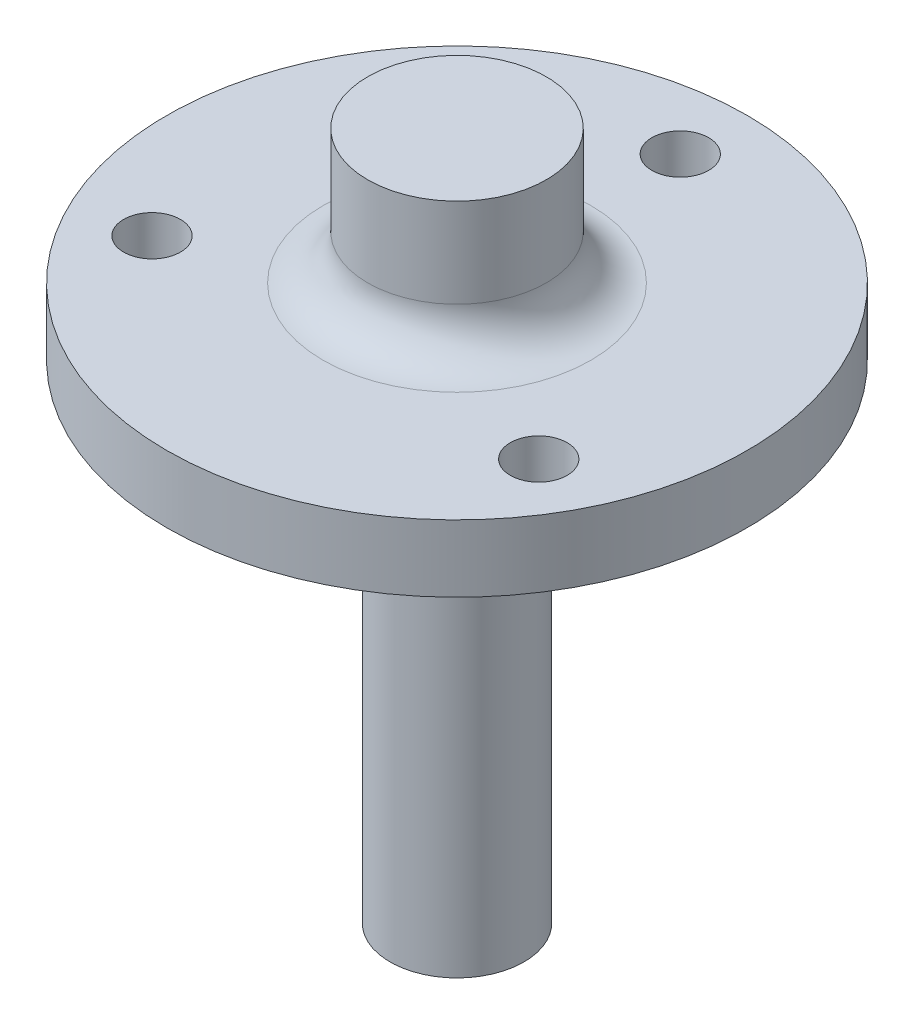
ISO-10303-21;
HEADER;
FILE_DESCRIPTION(('STEP AP214'),'2;1');
FILE_NAME('part.step','',(''),(''),'','','');
FILE_SCHEMA(('AUTOMOTIVE_DESIGN { 1 0 10303 214 1 1 1 1 }'));
ENDSEC;
DATA;
#1=APPLICATION_CONTEXT('core data for automotive mechanical design processes');
#2=APPLICATION_PROTOCOL_DEFINITION('international standard','automotive_design',2000,#1);
#3=PRODUCT_CONTEXT('',#1,'mechanical');
#4=PRODUCT('Part','Part','',(#3));
#5=PRODUCT_RELATED_PRODUCT_CATEGORY('part','',(#4));
#6=PRODUCT_DEFINITION_FORMATION('','',#4);
#7=PRODUCT_DEFINITION_CONTEXT('part definition',#1,'design');
#8=PRODUCT_DEFINITION('design','',#6,#7);
#9=PRODUCT_DEFINITION_SHAPE('','',#8);
#10=(LENGTH_UNIT() NAMED_UNIT(*) SI_UNIT(.MILLI.,.METRE.));
#11=(NAMED_UNIT(*) PLANE_ANGLE_UNIT() SI_UNIT($,.RADIAN.));
#12=(NAMED_UNIT(*) SI_UNIT($,.STERADIAN.) SOLID_ANGLE_UNIT());
#13=UNCERTAINTY_MEASURE_WITH_UNIT(LENGTH_MEASURE(1.E-05),#10,'distance_accuracy_value','');
#14=(GEOMETRIC_REPRESENTATION_CONTEXT(3) GLOBAL_UNCERTAINTY_ASSIGNED_CONTEXT((#13)) GLOBAL_UNIT_ASSIGNED_CONTEXT((#10,
#11,#12)) REPRESENTATION_CONTEXT('',''));
#15=CARTESIAN_POINT('',(0.,0.,0.));
#16=DIRECTION('',(0.,0.,1.));
#17=DIRECTION('',(1.,0.,0.));
#18=AXIS2_PLACEMENT_3D('',#15,#16,#17);
#19=CARTESIAN_POINT('',(0.,4.7625,0.));
#20=DIRECTION('',(0.,-1.,0.));
#21=DIRECTION('',(0.,0.,-1.));
#22=AXIS2_PLACEMENT_3D('',#19,#20,#21);
#23=CYLINDRICAL_SURFACE('',#22,20.6375);
#24=CARTESIAN_POINT('',(0.,4.7625,0.));
#25=DIRECTION('',(0.,1.,0.));
#26=DIRECTION('',(0.,0.,1.));
#27=AXIS2_PLACEMENT_3D('',#24,#25,#26);
#28=CIRCLE('',#27,20.6375);
#29=CARTESIAN_POINT('',(0.,4.7625,20.6375));
#30=VERTEX_POINT('',#29);
#31=EDGE_CURVE('E75',#30,#30,#28,.T.);
#32=ORIENTED_EDGE('',*,*,#31,.F.);
#33=EDGE_LOOP('',(#32));
#34=FACE_BOUND('',#33,.T.);
#35=CARTESIAN_POINT('',(0.,0.,0.));
#36=DIRECTION('',(0.,1.,0.));
#37=DIRECTION('',(0.,0.,1.));
#38=AXIS2_PLACEMENT_3D('',#35,#36,#37);
#39=CIRCLE('',#38,20.6375);
#40=CARTESIAN_POINT('',(0.,0.,20.6375));
#41=VERTEX_POINT('',#40);
#42=EDGE_CURVE('E72',#41,#41,#39,.T.);
#43=ORIENTED_EDGE('',*,*,#42,.T.);
#44=EDGE_LOOP('',(#43));
#45=FACE_BOUND('',#44,.T.);
#46=ADVANCED_FACE('F35',(#34,#45),#23,.T.);
#47=CARTESIAN_POINT('',(0.,4.7625,0.));
#48=DIRECTION('',(0.,1.,0.));
#49=DIRECTION('',(0.,0.,1.));
#50=AXIS2_PLACEMENT_3D('',#47,#48,#49);
#51=PLANE('',#50);
#52=CARTESIAN_POINT('',(0.,4.7625,0.));
#53=DIRECTION('',(0.,1.,0.));
#54=DIRECTION('',(0.,0.,1.));
#55=AXIS2_PLACEMENT_3D('',#52,#53,#54);
#56=CIRCLE('',#55,9.525);
#57=CARTESIAN_POINT('',(0.,4.7625,9.525));
#58=VERTEX_POINT('',#57);
#59=EDGE_CURVE('E11',#58,#58,#56,.F.);
#60=ORIENTED_EDGE('',*,*,#59,.T.);
#61=EDGE_LOOP('',(#60));
#62=FACE_BOUND('',#61,.T.);
#63=CARTESIAN_POINT('',(13.748153285078,4.7625,7.9375));
#64=DIRECTION('',(0.,-1.,0.));
#65=DIRECTION('',(0.,0.,-1.));
#66=AXIS2_PLACEMENT_3D('',#63,#64,#65);
#67=CIRCLE('',#66,2.0193);
#68=CARTESIAN_POINT('',(13.748153285078,4.7625,5.9182));
#69=VERTEX_POINT('',#68);
#70=EDGE_CURVE('E266',#69,#69,#67,.T.);
#71=ORIENTED_EDGE('',*,*,#70,.T.);
#72=EDGE_LOOP('',(#71));
#73=FACE_BOUND('',#72,.T.);
#74=CARTESIAN_POINT('',(0.,4.7625,-15.875));
#75=DIRECTION('',(0.,-1.,0.));
#76=DIRECTION('',(0.,0.,-1.));
#77=AXIS2_PLACEMENT_3D('',#74,#75,#76);
#78=CIRCLE('',#77,2.0193);
#79=CARTESIAN_POINT('',(0.,4.7625,-17.8943));
#80=VERTEX_POINT('',#79);
#81=EDGE_CURVE('E279',#80,#80,#78,.T.);
#82=ORIENTED_EDGE('',*,*,#81,.T.);
#83=EDGE_LOOP('',(#82));
#84=FACE_BOUND('',#83,.T.);
#85=CARTESIAN_POINT('',(-13.748153285078,4.7625,7.9375));
#86=DIRECTION('',(0.,-1.,0.));
#87=DIRECTION('',(0.,0.,-1.));
#88=AXIS2_PLACEMENT_3D('',#85,#86,#87);
#89=CIRCLE('',#88,2.0193);
#90=CARTESIAN_POINT('',(-13.748153285078,4.7625,5.9182));
#91=VERTEX_POINT('',#90);
#92=EDGE_CURVE('E285',#91,#91,#89,.T.);
#93=ORIENTED_EDGE('',*,*,#92,.T.);
#94=EDGE_LOOP('',(#93));
#95=FACE_BOUND('',#94,.T.);
#96=ORIENTED_EDGE('',*,*,#31,.T.);
#97=EDGE_LOOP('',(#96));
#98=FACE_BOUND('',#97,.T.);
#99=ADVANCED_FACE('F95',(#62,#73,#84,#95,#98),#51,.T.);
#100=CARTESIAN_POINT('',(0.,0.,0.));
#101=DIRECTION('',(0.,1.,0.));
#102=DIRECTION('',(0.,0.,1.));
#103=AXIS2_PLACEMENT_3D('',#100,#101,#102);
#104=PLANE('',#103);
#105=CARTESIAN_POINT('',(13.748153285078,0.,7.9375));
#106=DIRECTION('',(0.,-1.,0.));
#107=DIRECTION('',(0.,0.,-1.));
#108=AXIS2_PLACEMENT_3D('',#105,#106,#107);
#109=CIRCLE('',#108,2.01929999999999);
#110=CARTESIAN_POINT('',(13.748153285078,0.,5.91820000000001));
#111=VERTEX_POINT('',#110);
#112=EDGE_CURVE('E269',#111,#111,#109,.T.);
#113=ORIENTED_EDGE('',*,*,#112,.F.);
#114=EDGE_LOOP('',(#113));
#115=FACE_BOUND('',#114,.T.);
#116=CARTESIAN_POINT('',(0.,0.,-15.875));
#117=DIRECTION('',(0.,-1.,0.));
#118=DIRECTION('',(0.,0.,-1.));
#119=AXIS2_PLACEMENT_3D('',#116,#117,#118);
#120=CIRCLE('',#119,2.01929999999999);
#121=CARTESIAN_POINT('',(0.,0.,-17.8943));
#122=VERTEX_POINT('',#121);
#123=EDGE_CURVE('E272',#122,#122,#120,.T.);
#124=ORIENTED_EDGE('',*,*,#123,.F.);
#125=EDGE_LOOP('',(#124));
#126=FACE_BOUND('',#125,.T.);
#127=CARTESIAN_POINT('',(-13.748153285078,0.,7.9375));
#128=DIRECTION('',(0.,-1.,0.));
#129=DIRECTION('',(0.,0.,-1.));
#130=AXIS2_PLACEMENT_3D('',#127,#128,#129);
#131=CIRCLE('',#130,2.01929999999999);
#132=CARTESIAN_POINT('',(-13.748153285078,0.,5.91820000000001));
#133=VERTEX_POINT('',#132);
#134=EDGE_CURVE('E282',#133,#133,#131,.T.);
#135=ORIENTED_EDGE('',*,*,#134,.F.);
#136=EDGE_LOOP('',(#135));
#137=FACE_BOUND('',#136,.T.);
#138=CARTESIAN_POINT('',(0.,0.,0.));
#139=DIRECTION('',(0.,-1.,0.));
#140=DIRECTION('',(0.,0.,-1.));
#141=AXIS2_PLACEMENT_3D('',#138,#139,#140);
#142=CIRCLE('',#141,8.73125);
#143=CARTESIAN_POINT('',(0.,0.,-8.73125));
#144=VERTEX_POINT('',#143);
#145=EDGE_CURVE('E69',#144,#144,#142,.T.);
#146=ORIENTED_EDGE('',*,*,#145,.F.);
#147=EDGE_LOOP('',(#146));
#148=FACE_BOUND('',#147,.T.);
#149=ORIENTED_EDGE('',*,*,#42,.F.);
#150=EDGE_LOOP('',(#149));
#151=FACE_BOUND('',#150,.T.);
#152=ADVANCED_FACE('F101',(#115,#126,#137,#148,#151),#104,.F.);
#153=CARTESIAN_POINT('',(0.,-6.096,0.));
#154=DIRECTION('',(0.,1.,0.));
#155=DIRECTION('',(0.,0.,1.));
#156=AXIS2_PLACEMENT_3D('',#153,#154,#155);
#157=CYLINDRICAL_SURFACE('',#156,8.73125);
#158=CARTESIAN_POINT('',(0.,-6.096,0.));
#159=DIRECTION('',(0.,-1.,0.));
#160=DIRECTION('',(0.,0.,-1.));
#161=AXIS2_PLACEMENT_3D('',#158,#159,#160);
#162=CIRCLE('',#161,8.73125);
#163=CARTESIAN_POINT('',(0.,-6.096,-8.73125));
#164=VERTEX_POINT('',#163);
#165=EDGE_CURVE('E59',#164,#164,#162,.T.);
#166=ORIENTED_EDGE('',*,*,#165,.F.);
#167=EDGE_LOOP('',(#166));
#168=FACE_BOUND('',#167,.T.);
#169=ORIENTED_EDGE('',*,*,#145,.T.);
#170=EDGE_LOOP('',(#169));
#171=FACE_BOUND('',#170,.T.);
#172=ADVANCED_FACE('F108',(#168,#171),#157,.T.);
#173=CARTESIAN_POINT('',(0.,-6.096,0.));
#174=DIRECTION('',(0.,-1.,0.));
#175=DIRECTION('',(0.,0.,-1.));
#176=AXIS2_PLACEMENT_3D('',#173,#174,#175);
#177=PLANE('',#176);
#178=CARTESIAN_POINT('',(0.,-6.096,0.));
#179=DIRECTION('',(0.,-1.,0.));
#180=DIRECTION('',(0.,0.,-1.));
#181=AXIS2_PLACEMENT_3D('',#178,#179,#180);
#182=CIRCLE('',#181,4.7625);
#183=CARTESIAN_POINT('',(0.,-6.096,-4.7625));
#184=VERTEX_POINT('',#183);
#185=EDGE_CURVE('E66',#184,#184,#182,.T.);
#186=ORIENTED_EDGE('',*,*,#185,.F.);
#187=EDGE_LOOP('',(#186));
#188=FACE_BOUND('',#187,.T.);
#189=ORIENTED_EDGE('',*,*,#165,.T.);
#190=EDGE_LOOP('',(#189));
#191=FACE_BOUND('',#190,.T.);
#192=ADVANCED_FACE('F113',(#188,#191),#177,.T.);
#193=CARTESIAN_POINT('',(0.,-34.671,0.));
#194=DIRECTION('',(0.,1.,0.));
#195=DIRECTION('',(0.,0.,1.));
#196=AXIS2_PLACEMENT_3D('',#193,#194,#195);
#197=CYLINDRICAL_SURFACE('',#196,4.7625);
#198=CARTESIAN_POINT('',(0.,-34.671,0.));
#199=DIRECTION('',(0.,-1.,0.));
#200=DIRECTION('',(0.,0.,-1.));
#201=AXIS2_PLACEMENT_3D('',#198,#199,#200);
#202=CIRCLE('',#201,4.7625);
#203=CARTESIAN_POINT('',(0.,-34.671,-4.7625));
#204=VERTEX_POINT('',#203);
#205=EDGE_CURVE('E55',#204,#204,#202,.T.);
#206=ORIENTED_EDGE('',*,*,#205,.F.);
#207=EDGE_LOOP('',(#206));
#208=FACE_BOUND('',#207,.T.);
#209=ORIENTED_EDGE('',*,*,#185,.T.);
#210=EDGE_LOOP('',(#209));
#211=FACE_BOUND('',#210,.T.);
#212=ADVANCED_FACE('F117',(#208,#211),#197,.T.);
#213=CARTESIAN_POINT('',(0.,-34.671,0.));
#214=DIRECTION('',(0.,-1.,0.));
#215=DIRECTION('',(0.,0.,-1.));
#216=AXIS2_PLACEMENT_3D('',#213,#214,#215);
#217=PLANE('',#216);
#218=CARTESIAN_POINT('',(0.,-34.671,0.));
#219=DIRECTION('',(0.,-1.,0.));
#220=DIRECTION('',(0.,0.,-1.));
#221=AXIS2_PLACEMENT_3D('',#218,#219,#220);
#222=CIRCLE('',#221,3.17499999999999);
#223=CARTESIAN_POINT('',(0.,-34.671,-3.17499999999999));
#224=VERTEX_POINT('',#223);
#225=EDGE_CURVE('E288',#224,#224,#222,.T.);
#226=ORIENTED_EDGE('',*,*,#225,.F.);
#227=EDGE_LOOP('',(#226));
#228=FACE_BOUND('',#227,.T.);
#229=ORIENTED_EDGE('',*,*,#205,.T.);
#230=EDGE_LOOP('',(#229));
#231=FACE_BOUND('',#230,.T.);
#232=ADVANCED_FACE('F49',(#228,#231),#217,.T.);
#233=CARTESIAN_POINT('',(0.,-5.46100000000001,0.));
#234=DIRECTION('',(0.,-1.,0.));
#235=DIRECTION('',(0.,0.,-1.));
#236=AXIS2_PLACEMENT_3D('',#233,#234,#235);
#237=CONICAL_SURFACE('',#236,2.55269999999999,1.02974425867665);
#238=CARTESIAN_POINT('',(0.,-3.92718309780837,0.));
#239=VERTEX_POINT('',#238);
#240=VERTEX_LOOP('',#239);
#241=FACE_BOUND('',#240,.T.);
#242=CARTESIAN_POINT('',(0.,-5.46100000000001,0.));
#243=DIRECTION('',(0.,-1.,0.));
#244=DIRECTION('',(0.,0.,-1.));
#245=AXIS2_PLACEMENT_3D('',#242,#243,#244);
#246=CIRCLE('',#245,2.55269999999999);
#247=CARTESIAN_POINT('',(0.,-5.46100000000001,-2.55269999999999));
#248=VERTEX_POINT('',#247);
#249=EDGE_CURVE('E53',#248,#248,#246,.T.);
#250=ORIENTED_EDGE('',*,*,#249,.T.);
#251=EDGE_LOOP('',(#250));
#252=FACE_BOUND('',#251,.T.);
#253=ADVANCED_FACE('F45',(#241,#252),#237,.F.);
#254=CARTESIAN_POINT('',(0.,-34.671,0.));
#255=DIRECTION('',(0.,-1.,0.));
#256=DIRECTION('',(0.,0.,-1.));
#257=AXIS2_PLACEMENT_3D('',#254,#255,#256);
#258=CYLINDRICAL_SURFACE('',#257,2.55269999999999);
#259=ORIENTED_EDGE('',*,*,#249,.F.);
#260=EDGE_LOOP('',(#259));
#261=FACE_BOUND('',#260,.T.);
#262=CARTESIAN_POINT('',(0.,-9.271,0.));
#263=DIRECTION('',(0.,-1.,0.));
#264=DIRECTION('',(0.,0.,-1.));
#265=AXIS2_PLACEMENT_3D('',#262,#263,#264);
#266=CIRCLE('',#265,2.55269999999999);
#267=CARTESIAN_POINT('',(0.,-9.271,-2.55269999999999));
#268=VERTEX_POINT('',#267);
#269=EDGE_CURVE('E56',#268,#268,#266,.T.);
#270=ORIENTED_EDGE('',*,*,#269,.T.);
#271=EDGE_LOOP('',(#270));
#272=FACE_BOUND('',#271,.T.);
#273=ADVANCED_FACE('F48',(#261,#272),#258,.F.);
#274=CARTESIAN_POINT('',(2.55269999999999,-9.271,0.));
#275=DIRECTION('',(0.,1.,0.));
#276=DIRECTION('',(0.,0.,1.));
#277=AXIS2_PLACEMENT_3D('',#274,#275,#276);
#278=PLANE('',#277);
#279=ORIENTED_EDGE('',*,*,#269,.F.);
#280=EDGE_LOOP('',(#279));
#281=FACE_BOUND('',#280,.T.);
#282=CARTESIAN_POINT('',(0.,-9.271,0.));
#283=DIRECTION('',(0.,-1.,0.));
#284=DIRECTION('',(0.,0.,-1.));
#285=AXIS2_PLACEMENT_3D('',#282,#283,#284);
#286=CIRCLE('',#285,3.17499999999999);
#287=CARTESIAN_POINT('',(0.,-9.271,-3.17499999999999));
#288=VERTEX_POINT('',#287);
#289=EDGE_CURVE('E62',#288,#288,#286,.T.);
#290=ORIENTED_EDGE('',*,*,#289,.T.);
#291=EDGE_LOOP('',(#290));
#292=FACE_BOUND('',#291,.T.);
#293=ADVANCED_FACE('F127',(#281,#292),#278,.F.);
#294=CARTESIAN_POINT('',(0.,-34.671,0.));
#295=DIRECTION('',(0.,-1.,0.));
#296=DIRECTION('',(0.,0.,-1.));
#297=AXIS2_PLACEMENT_3D('',#294,#295,#296);
#298=CYLINDRICAL_SURFACE('',#297,3.17499999999999);
#299=ORIENTED_EDGE('',*,*,#289,.F.);
#300=EDGE_LOOP('',(#299));
#301=FACE_BOUND('',#300,.T.);
#302=ORIENTED_EDGE('',*,*,#225,.T.);
#303=EDGE_LOOP('',(#302));
#304=FACE_BOUND('',#303,.T.);
#305=ADVANCED_FACE('F130',(#301,#304),#298,.F.);
#306=CARTESIAN_POINT('',(-13.748153285078,0.,7.9375));
#307=DIRECTION('',(0.,-1.,0.));
#308=DIRECTION('',(0.,0.,-1.));
#309=AXIS2_PLACEMENT_3D('',#306,#307,#308);
#310=CYLINDRICAL_SURFACE('',#309,2.01929999999999);
#311=ORIENTED_EDGE('',*,*,#92,.F.);
#312=EDGE_LOOP('',(#311));
#313=FACE_BOUND('',#312,.T.);
#314=ORIENTED_EDGE('',*,*,#134,.T.);
#315=EDGE_LOOP('',(#314));
#316=FACE_BOUND('',#315,.T.);
#317=ADVANCED_FACE('F134',(#313,#316),#310,.F.);
#318=CARTESIAN_POINT('',(0.,0.,-15.875));
#319=DIRECTION('',(0.,-1.,0.));
#320=DIRECTION('',(0.,0.,-1.));
#321=AXIS2_PLACEMENT_3D('',#318,#319,#320);
#322=CYLINDRICAL_SURFACE('',#321,2.01929999999999);
#323=ORIENTED_EDGE('',*,*,#81,.F.);
#324=EDGE_LOOP('',(#323));
#325=FACE_BOUND('',#324,.T.);
#326=ORIENTED_EDGE('',*,*,#123,.T.);
#327=EDGE_LOOP('',(#326));
#328=FACE_BOUND('',#327,.T.);
#329=ADVANCED_FACE('F138',(#325,#328),#322,.F.);
#330=CARTESIAN_POINT('',(13.748153285078,0.,7.9375));
#331=DIRECTION('',(0.,-1.,0.));
#332=DIRECTION('',(0.,0.,-1.));
#333=AXIS2_PLACEMENT_3D('',#330,#331,#332);
#334=CYLINDRICAL_SURFACE('',#333,2.01929999999999);
#335=ORIENTED_EDGE('',*,*,#70,.F.);
#336=EDGE_LOOP('',(#335));
#337=FACE_BOUND('',#336,.T.);
#338=ORIENTED_EDGE('',*,*,#112,.T.);
#339=EDGE_LOOP('',(#338));
#340=FACE_BOUND('',#339,.T.);
#341=ADVANCED_FACE('F142',(#337,#340),#334,.F.);
#342=CARTESIAN_POINT('',(0.,14.2875,0.));
#343=DIRECTION('',(0.,-1.,0.));
#344=DIRECTION('',(0.,0.,-1.));
#345=AXIS2_PLACEMENT_3D('',#342,#343,#344);
#346=CYLINDRICAL_SURFACE('',#345,6.35);
#347=CARTESIAN_POINT('',(0.,7.9375,0.));
#348=DIRECTION('',(0.,1.,0.));
#349=DIRECTION('',(0.,0.,1.));
#350=AXIS2_PLACEMENT_3D('',#347,#348,#349);
#351=CIRCLE('',#350,6.35);
#352=CARTESIAN_POINT('',(0.,7.9375,6.35));
#353=VERTEX_POINT('',#352);
#354=EDGE_CURVE('E42',#353,#353,#351,.T.);
#355=ORIENTED_EDGE('',*,*,#354,.T.);
#356=EDGE_LOOP('',(#355));
#357=FACE_BOUND('',#356,.T.);
#358=CARTESIAN_POINT('',(0.,14.2875,0.));
#359=DIRECTION('',(0.,1.,0.));
#360=DIRECTION('',(0.,0.,1.));
#361=AXIS2_PLACEMENT_3D('',#358,#359,#360);
#362=CIRCLE('',#361,6.35);
#363=CARTESIAN_POINT('',(0.,14.2875,6.35));
#364=VERTEX_POINT('',#363);
#365=EDGE_CURVE('E270',#364,#364,#362,.T.);
#366=ORIENTED_EDGE('',*,*,#365,.F.);
#367=EDGE_LOOP('',(#366));
#368=FACE_BOUND('',#367,.T.);
#369=ADVANCED_FACE('F82',(#357,#368),#346,.T.);
#370=CARTESIAN_POINT('',(0.,14.2875,0.));
#371=DIRECTION('',(0.,1.,0.));
#372=DIRECTION('',(0.,0.,1.));
#373=AXIS2_PLACEMENT_3D('',#370,#371,#372);
#374=PLANE('',#373);
#375=ORIENTED_EDGE('',*,*,#365,.T.);
#376=EDGE_LOOP('',(#375));
#377=FACE_BOUND('',#376,.T.);
#378=ADVANCED_FACE('F86',(#377),#374,.T.);
#379=CARTESIAN_POINT('',(0.,7.9375,0.));
#380=DIRECTION('',(0.,1.,0.));
#381=DIRECTION('',(0.,0.,1.));
#382=AXIS2_PLACEMENT_3D('',#379,#380,#381);
#383=TOROIDAL_SURFACE('',#382,9.525,3.175);
#384=ORIENTED_EDGE('',*,*,#59,.F.);
#385=EDGE_LOOP('',(#384));
#386=FACE_BOUND('',#385,.T.);
#387=ORIENTED_EDGE('',*,*,#354,.F.);
#388=EDGE_LOOP('',(#387));
#389=FACE_BOUND('',#388,.T.);
#390=ADVANCED_FACE('F37',(#386,#389),#383,.F.);
#391=CLOSED_SHELL('',(#46,#99,#152,#172,#192,#212,#232,#253,#273,#293,#305,#317,#329,#341,#369,
#378,#390));
#392=MANIFOLD_SOLID_BREP('B2',#391);
#393=ADVANCED_BREP_SHAPE_REPRESENTATION('',(#18,#392),#14);
#394=SHAPE_DEFINITION_REPRESENTATION(#9,#393);
ENDSEC;
END-ISO-10303-21;
